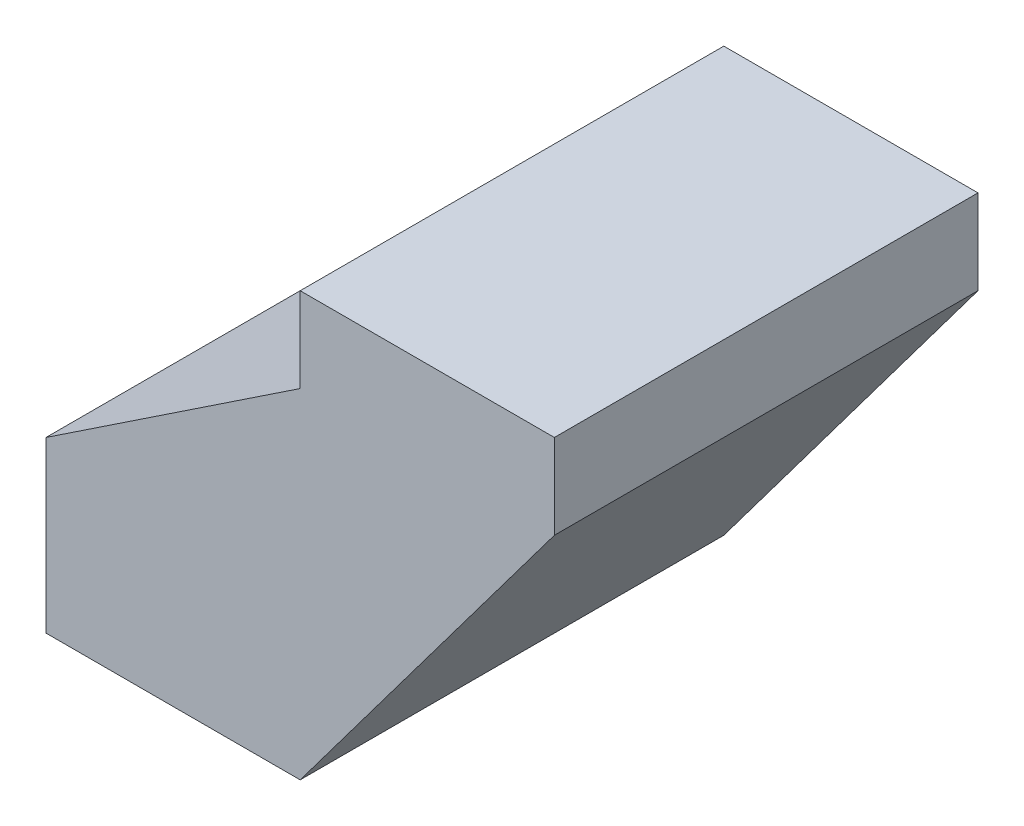
ISO-10303-21;
HEADER;
FILE_DESCRIPTION(('STEP AP214'),'2;1');
FILE_NAME('part.step','',(''),(''),'','','');
FILE_SCHEMA(('AUTOMOTIVE_DESIGN { 1 0 10303 214 1 1 1 1 }'));
ENDSEC;
DATA;
#1=APPLICATION_CONTEXT('core data for automotive mechanical design processes');
#2=APPLICATION_PROTOCOL_DEFINITION('international standard','automotive_design',2000,#1);
#3=PRODUCT_CONTEXT('',#1,'mechanical');
#4=PRODUCT('Part','Part','',(#3));
#5=PRODUCT_RELATED_PRODUCT_CATEGORY('part','',(#4));
#6=PRODUCT_DEFINITION_FORMATION('','',#4);
#7=PRODUCT_DEFINITION_CONTEXT('part definition',#1,'design');
#8=PRODUCT_DEFINITION('design','',#6,#7);
#9=PRODUCT_DEFINITION_SHAPE('','',#8);
#10=(LENGTH_UNIT() NAMED_UNIT(*) SI_UNIT(.MILLI.,.METRE.));
#11=(NAMED_UNIT(*) PLANE_ANGLE_UNIT() SI_UNIT($,.RADIAN.));
#12=(NAMED_UNIT(*) SI_UNIT($,.STERADIAN.) SOLID_ANGLE_UNIT());
#13=UNCERTAINTY_MEASURE_WITH_UNIT(LENGTH_MEASURE(1.E-05),#10,'distance_accuracy_value','');
#14=(GEOMETRIC_REPRESENTATION_CONTEXT(3) GLOBAL_UNCERTAINTY_ASSIGNED_CONTEXT((#13)) GLOBAL_UNIT_ASSIGNED_CONTEXT((#10,
#11,#12)) REPRESENTATION_CONTEXT('',''));
#15=CARTESIAN_POINT('',(0.,0.,0.));
#16=DIRECTION('',(0.,0.,1.));
#17=DIRECTION('',(1.,0.,0.));
#18=AXIS2_PLACEMENT_3D('',#15,#16,#17);
#19=CARTESIAN_POINT('',(0.,20.,25.));
#20=DIRECTION('',(1.,0.,0.));
#21=DIRECTION('',(0.,1.,0.));
#22=AXIS2_PLACEMENT_3D('',#19,#20,#21);
#23=PLANE('',#22);
#24=DIRECTION('',(0.,-1.,0.));
#25=VECTOR('',#24,1.);
#26=CARTESIAN_POINT('',(0.,20.,0.));
#27=LINE('',#26,#25);
#28=CARTESIAN_POINT('',(0.,25.,0.));
#29=VERTEX_POINT('',#28);
#30=CARTESIAN_POINT('',(0.,20.,0.));
#31=VERTEX_POINT('',#30);
#32=EDGE_CURVE('E123',#29,#31,#27,.T.);
#33=ORIENTED_EDGE('',*,*,#32,.T.);
#34=DIRECTION('',(0.,0.,-1.));
#35=VECTOR('',#34,1.);
#36=CARTESIAN_POINT('',(0.,20.,25.));
#37=LINE('',#36,#35);
#38=CARTESIAN_POINT('',(0.,20.,25.));
#39=VERTEX_POINT('',#38);
#40=EDGE_CURVE('E11',#39,#31,#37,.T.);
#41=ORIENTED_EDGE('',*,*,#40,.F.);
#42=DIRECTION('',(0.,-1.,0.));
#43=VECTOR('',#42,1.);
#44=CARTESIAN_POINT('',(0.,20.,25.));
#45=LINE('',#44,#43);
#46=CARTESIAN_POINT('',(0.,25.,25.));
#47=VERTEX_POINT('',#46);
#48=EDGE_CURVE('E135',#47,#39,#45,.T.);
#49=ORIENTED_EDGE('',*,*,#48,.F.);
#50=DIRECTION('',(0.,0.,-1.));
#51=VECTOR('',#50,1.);
#52=CARTESIAN_POINT('',(0.,25.,25.));
#53=LINE('',#52,#51);
#54=EDGE_CURVE('E119',#47,#29,#53,.T.);
#55=ORIENTED_EDGE('',*,*,#54,.T.);
#56=EDGE_LOOP('',(#33,#41,#49,#55));
#57=FACE_BOUND('',#56,.T.);
#58=ADVANCED_FACE('F33',(#57),#23,.F.);
#59=CARTESIAN_POINT('',(-15.,10.,25.));
#60=DIRECTION('',(0.554700196225229,-0.832050294337844,0.));
#61=DIRECTION('',(0.832050294337844,0.554700196225229,0.));
#62=AXIS2_PLACEMENT_3D('',#59,#60,#61);
#63=PLANE('',#62);
#64=DIRECTION('',(-0.832050294337844,-0.554700196225229,0.));
#65=VECTOR('',#64,1.);
#66=CARTESIAN_POINT('',(-15.,10.,0.));
#67=LINE('',#66,#65);
#68=CARTESIAN_POINT('',(-15.,10.,0.));
#69=VERTEX_POINT('',#68);
#70=EDGE_CURVE('E126',#31,#69,#67,.T.);
#71=ORIENTED_EDGE('',*,*,#70,.T.);
#72=DIRECTION('',(0.,0.,-1.));
#73=VECTOR('',#72,1.);
#74=CARTESIAN_POINT('',(-15.,10.,25.));
#75=LINE('',#74,#73);
#76=CARTESIAN_POINT('',(-15.,10.,25.));
#77=VERTEX_POINT('',#76);
#78=EDGE_CURVE('E41',#77,#69,#75,.T.);
#79=ORIENTED_EDGE('',*,*,#78,.F.);
#80=DIRECTION('',(-0.832050294337844,-0.554700196225229,0.));
#81=VECTOR('',#80,1.);
#82=CARTESIAN_POINT('',(-15.,10.,25.));
#83=LINE('',#82,#81);
#84=EDGE_CURVE('E89',#39,#77,#83,.T.);
#85=ORIENTED_EDGE('',*,*,#84,.F.);
#86=ORIENTED_EDGE('',*,*,#40,.T.);
#87=EDGE_LOOP('',(#71,#79,#85,#86));
#88=FACE_BOUND('',#87,.T.);
#89=ADVANCED_FACE('F160',(#88),#63,.F.);
#90=CARTESIAN_POINT('',(-15.,0.,25.));
#91=DIRECTION('',(1.,0.,0.));
#92=DIRECTION('',(0.,0.,-1.));
#93=AXIS2_PLACEMENT_3D('',#90,#91,#92);
#94=PLANE('',#93);
#95=DIRECTION('',(0.,-1.,0.));
#96=VECTOR('',#95,1.);
#97=CARTESIAN_POINT('',(-15.,0.,0.));
#98=LINE('',#97,#96);
#99=CARTESIAN_POINT('',(-15.,0.,0.));
#100=VERTEX_POINT('',#99);
#101=EDGE_CURVE('E128',#69,#100,#98,.T.);
#102=ORIENTED_EDGE('',*,*,#101,.T.);
#103=DIRECTION('',(0.,0.,-1.));
#104=VECTOR('',#103,1.);
#105=CARTESIAN_POINT('',(-15.,0.,25.));
#106=LINE('',#105,#104);
#107=CARTESIAN_POINT('',(-15.,0.,25.));
#108=VERTEX_POINT('',#107);
#109=EDGE_CURVE('E139',#108,#100,#106,.T.);
#110=ORIENTED_EDGE('',*,*,#109,.F.);
#111=DIRECTION('',(0.,-1.,0.));
#112=VECTOR('',#111,1.);
#113=CARTESIAN_POINT('',(-15.,0.,25.));
#114=LINE('',#113,#112);
#115=EDGE_CURVE('E147',#77,#108,#114,.T.);
#116=ORIENTED_EDGE('',*,*,#115,.F.);
#117=ORIENTED_EDGE('',*,*,#78,.T.);
#118=EDGE_LOOP('',(#102,#110,#116,#117));
#119=FACE_BOUND('',#118,.T.);
#120=ADVANCED_FACE('F145',(#119),#94,.F.);
#121=CARTESIAN_POINT('',(0.,0.,25.));
#122=DIRECTION('',(0.,1.,0.));
#123=DIRECTION('',(-1.,0.,0.));
#124=AXIS2_PLACEMENT_3D('',#121,#122,#123);
#125=PLANE('',#124);
#126=DIRECTION('',(1.,0.,0.));
#127=VECTOR('',#126,1.);
#128=CARTESIAN_POINT('',(0.,0.,0.));
#129=LINE('',#128,#127);
#130=CARTESIAN_POINT('',(0.,0.,0.));
#131=VERTEX_POINT('',#130);
#132=EDGE_CURVE('E130',#100,#131,#129,.T.);
#133=ORIENTED_EDGE('',*,*,#132,.T.);
#134=DIRECTION('',(0.,0.,-1.));
#135=VECTOR('',#134,1.);
#136=CARTESIAN_POINT('',(0.,0.,25.));
#137=LINE('',#136,#135);
#138=CARTESIAN_POINT('',(0.,0.,25.));
#139=VERTEX_POINT('',#138);
#140=EDGE_CURVE('E114',#139,#131,#137,.T.);
#141=ORIENTED_EDGE('',*,*,#140,.F.);
#142=DIRECTION('',(1.,0.,0.));
#143=VECTOR('',#142,1.);
#144=CARTESIAN_POINT('',(0.,0.,25.));
#145=LINE('',#144,#143);
#146=EDGE_CURVE('E105',#108,#139,#145,.T.);
#147=ORIENTED_EDGE('',*,*,#146,.F.);
#148=ORIENTED_EDGE('',*,*,#109,.T.);
#149=EDGE_LOOP('',(#133,#141,#147,#148));
#150=FACE_BOUND('',#149,.T.);
#151=ADVANCED_FACE('F153',(#150),#125,.F.);
#152=CARTESIAN_POINT('',(15.,20.,25.));
#153=DIRECTION('',(-0.8,0.6,0.));
#154=DIRECTION('',(-0.6,-0.8,0.));
#155=AXIS2_PLACEMENT_3D('',#152,#153,#154);
#156=PLANE('',#155);
#157=DIRECTION('',(0.6,0.8,0.));
#158=VECTOR('',#157,1.);
#159=CARTESIAN_POINT('',(15.,20.,0.));
#160=LINE('',#159,#158);
#161=CARTESIAN_POINT('',(15.,20.,0.));
#162=VERTEX_POINT('',#161);
#163=EDGE_CURVE('E113',#131,#162,#160,.T.);
#164=ORIENTED_EDGE('',*,*,#163,.T.);
#165=DIRECTION('',(0.,0.,-1.));
#166=VECTOR('',#165,1.);
#167=CARTESIAN_POINT('',(15.,20.,25.));
#168=LINE('',#167,#166);
#169=CARTESIAN_POINT('',(15.,20.,25.));
#170=VERTEX_POINT('',#169);
#171=EDGE_CURVE('E110',#170,#162,#168,.T.);
#172=ORIENTED_EDGE('',*,*,#171,.F.);
#173=DIRECTION('',(0.6,0.8,0.));
#174=VECTOR('',#173,1.);
#175=CARTESIAN_POINT('',(15.,20.,25.));
#176=LINE('',#175,#174);
#177=EDGE_CURVE('E99',#139,#170,#176,.T.);
#178=ORIENTED_EDGE('',*,*,#177,.F.);
#179=ORIENTED_EDGE('',*,*,#140,.T.);
#180=EDGE_LOOP('',(#164,#172,#178,#179));
#181=FACE_BOUND('',#180,.T.);
#182=ADVANCED_FACE('F111',(#181),#156,.F.);
#183=CARTESIAN_POINT('',(15.,25.,25.));
#184=DIRECTION('',(-1.,0.,0.));
#185=DIRECTION('',(0.,0.,1.));
#186=AXIS2_PLACEMENT_3D('',#183,#184,#185);
#187=PLANE('',#186);
#188=DIRECTION('',(0.,1.,0.));
#189=VECTOR('',#188,1.);
#190=CARTESIAN_POINT('',(15.,25.,0.));
#191=LINE('',#190,#189);
#192=CARTESIAN_POINT('',(15.,25.,0.));
#193=VERTEX_POINT('',#192);
#194=EDGE_CURVE('E75',#162,#193,#191,.T.);
#195=ORIENTED_EDGE('',*,*,#194,.T.);
#196=DIRECTION('',(0.,0.,-1.));
#197=VECTOR('',#196,1.);
#198=CARTESIAN_POINT('',(15.,25.,25.));
#199=LINE('',#198,#197);
#200=CARTESIAN_POINT('',(15.,25.,25.));
#201=VERTEX_POINT('',#200);
#202=EDGE_CURVE('E115',#201,#193,#199,.T.);
#203=ORIENTED_EDGE('',*,*,#202,.F.);
#204=DIRECTION('',(0.,1.,0.));
#205=VECTOR('',#204,1.);
#206=CARTESIAN_POINT('',(15.,25.,25.));
#207=LINE('',#206,#205);
#208=EDGE_CURVE('E103',#170,#201,#207,.T.);
#209=ORIENTED_EDGE('',*,*,#208,.F.);
#210=ORIENTED_EDGE('',*,*,#171,.T.);
#211=EDGE_LOOP('',(#195,#203,#209,#210));
#212=FACE_BOUND('',#211,.T.);
#213=ADVANCED_FACE('F117',(#212),#187,.F.);
#214=CARTESIAN_POINT('',(0.,25.,25.));
#215=DIRECTION('',(0.,-1.,0.));
#216=DIRECTION('',(0.,0.,-1.));
#217=AXIS2_PLACEMENT_3D('',#214,#215,#216);
#218=PLANE('',#217);
#219=DIRECTION('',(-1.,0.,0.));
#220=VECTOR('',#219,1.);
#221=CARTESIAN_POINT('',(0.,25.,0.));
#222=LINE('',#221,#220);
#223=EDGE_CURVE('E81',#193,#29,#222,.T.);
#224=ORIENTED_EDGE('',*,*,#223,.T.);
#225=ORIENTED_EDGE('',*,*,#54,.F.);
#226=DIRECTION('',(-1.,0.,0.));
#227=VECTOR('',#226,1.);
#228=CARTESIAN_POINT('',(0.,25.,25.));
#229=LINE('',#228,#227);
#230=EDGE_CURVE('E49',#201,#47,#229,.T.);
#231=ORIENTED_EDGE('',*,*,#230,.F.);
#232=ORIENTED_EDGE('',*,*,#202,.T.);
#233=EDGE_LOOP('',(#224,#225,#231,#232));
#234=FACE_BOUND('',#233,.T.);
#235=ADVANCED_FACE('F174',(#234),#218,.F.);
#236=CARTESIAN_POINT('',(0.,0.,25.));
#237=DIRECTION('',(0.,0.,-1.));
#238=DIRECTION('',(-1.,0.,0.));
#239=AXIS2_PLACEMENT_3D('',#236,#237,#238);
#240=PLANE('',#239);
#241=ORIENTED_EDGE('',*,*,#48,.T.);
#242=ORIENTED_EDGE('',*,*,#84,.T.);
#243=ORIENTED_EDGE('',*,*,#115,.T.);
#244=ORIENTED_EDGE('',*,*,#146,.T.);
#245=ORIENTED_EDGE('',*,*,#177,.T.);
#246=ORIENTED_EDGE('',*,*,#208,.T.);
#247=ORIENTED_EDGE('',*,*,#230,.T.);
#248=EDGE_LOOP('',(#241,#242,#243,#244,#245,#246,#247));
#249=FACE_BOUND('',#248,.T.);
#250=ADVANCED_FACE('F101',(#249),#240,.F.);
#251=CARTESIAN_POINT('',(0.,0.,0.));
#252=DIRECTION('',(0.,0.,-1.));
#253=DIRECTION('',(-1.,0.,0.));
#254=AXIS2_PLACEMENT_3D('',#251,#252,#253);
#255=PLANE('',#254);
#256=ORIENTED_EDGE('',*,*,#32,.F.);
#257=ORIENTED_EDGE('',*,*,#223,.F.);
#258=ORIENTED_EDGE('',*,*,#194,.F.);
#259=ORIENTED_EDGE('',*,*,#163,.F.);
#260=ORIENTED_EDGE('',*,*,#132,.F.);
#261=ORIENTED_EDGE('',*,*,#101,.F.);
#262=ORIENTED_EDGE('',*,*,#70,.F.);
#263=EDGE_LOOP('',(#256,#257,#258,#259,#260,#261,#262));
#264=FACE_BOUND('',#263,.T.);
#265=ADVANCED_FACE('F151',(#264),#255,.T.);
#266=CLOSED_SHELL('',(#58,#89,#120,#151,#182,#213,#235,#250,#265));
#267=MANIFOLD_SOLID_BREP('B2',#266);
#268=ADVANCED_BREP_SHAPE_REPRESENTATION('',(#18,#267),#14);
#269=SHAPE_DEFINITION_REPRESENTATION(#9,#268);
ENDSEC;
END-ISO-10303-21;
